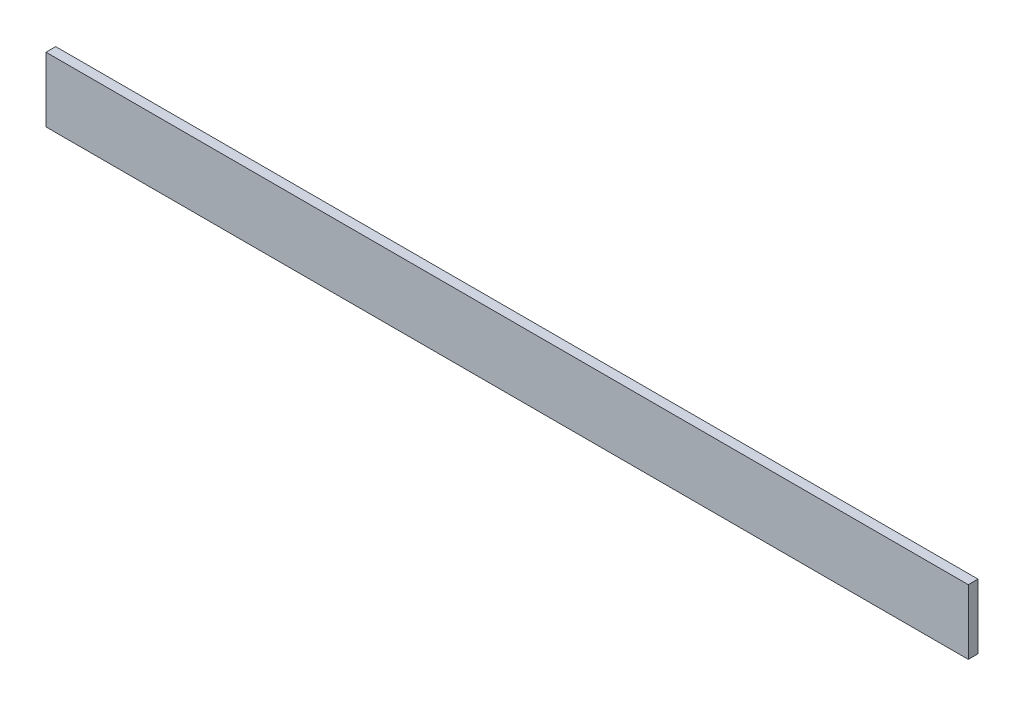
ISO-10303-21;
HEADER;
FILE_DESCRIPTION(('STEP AP214'),'2;1');
FILE_NAME('part.step','',(''),(''),'','','');
FILE_SCHEMA(('AUTOMOTIVE_DESIGN { 1 0 10303 214 1 1 1 1 }'));
ENDSEC;
DATA;
#1=APPLICATION_CONTEXT('core data for automotive mechanical design processes');
#2=APPLICATION_PROTOCOL_DEFINITION('international standard','automotive_design',2000,#1);
#3=PRODUCT_CONTEXT('',#1,'mechanical');
#4=PRODUCT('Part','Part','',(#3));
#5=PRODUCT_RELATED_PRODUCT_CATEGORY('part','',(#4));
#6=PRODUCT_DEFINITION_FORMATION('','',#4);
#7=PRODUCT_DEFINITION_CONTEXT('part definition',#1,'design');
#8=PRODUCT_DEFINITION('design','',#6,#7);
#9=PRODUCT_DEFINITION_SHAPE('','',#8);
#10=(LENGTH_UNIT() NAMED_UNIT(*) SI_UNIT(.MILLI.,.METRE.));
#11=(NAMED_UNIT(*) PLANE_ANGLE_UNIT() SI_UNIT($,.RADIAN.));
#12=(NAMED_UNIT(*) SI_UNIT($,.STERADIAN.) SOLID_ANGLE_UNIT());
#13=UNCERTAINTY_MEASURE_WITH_UNIT(LENGTH_MEASURE(1.E-05),#10,'distance_accuracy_value','');
#14=(GEOMETRIC_REPRESENTATION_CONTEXT(3) GLOBAL_UNCERTAINTY_ASSIGNED_CONTEXT((#13)) GLOBAL_UNIT_ASSIGNED_CONTEXT((#10,
#11,#12)) REPRESENTATION_CONTEXT('',''));
#15=CARTESIAN_POINT('',(0.,0.,0.));
#16=DIRECTION('',(0.,0.,1.));
#17=DIRECTION('',(1.,0.,0.));
#18=AXIS2_PLACEMENT_3D('',#15,#16,#17);
#19=CARTESIAN_POINT('',(142.5,23.,-70.5));
#20=DIRECTION('',(-1.,0.,0.));
#21=DIRECTION('',(0.,0.,1.));
#22=AXIS2_PLACEMENT_3D('',#19,#20,#21);
#23=PLANE('',#22);
#24=DIRECTION('',(0.,-1.,0.));
#25=VECTOR('',#24,1.);
#26=CARTESIAN_POINT('',(142.5,23.,-67.5));
#27=LINE('',#26,#25);
#28=CARTESIAN_POINT('',(142.5,23.,-67.5));
#29=VERTEX_POINT('',#28);
#30=CARTESIAN_POINT('',(142.5,3.,-67.5));
#31=VERTEX_POINT('',#30);
#32=EDGE_CURVE('E96',#29,#31,#27,.T.);
#33=ORIENTED_EDGE('',*,*,#32,.T.);
#34=DIRECTION('',(0.,0.,1.));
#35=VECTOR('',#34,1.);
#36=CARTESIAN_POINT('',(142.5,3.,-70.5));
#37=LINE('',#36,#35);
#38=CARTESIAN_POINT('',(142.5,3.,-70.5));
#39=VERTEX_POINT('',#38);
#40=EDGE_CURVE('E11',#39,#31,#37,.T.);
#41=ORIENTED_EDGE('',*,*,#40,.F.);
#42=DIRECTION('',(0.,-1.,0.));
#43=VECTOR('',#42,1.);
#44=CARTESIAN_POINT('',(142.5,23.,-70.5));
#45=LINE('',#44,#43);
#46=CARTESIAN_POINT('',(142.5,23.,-70.5));
#47=VERTEX_POINT('',#46);
#48=EDGE_CURVE('E84',#47,#39,#45,.T.);
#49=ORIENTED_EDGE('',*,*,#48,.F.);
#50=DIRECTION('',(0.,0.,1.));
#51=VECTOR('',#50,1.);
#52=CARTESIAN_POINT('',(142.5,23.,-70.5));
#53=LINE('',#52,#51);
#54=EDGE_CURVE('E92',#47,#29,#53,.T.);
#55=ORIENTED_EDGE('',*,*,#54,.T.);
#56=EDGE_LOOP('',(#33,#41,#49,#55));
#57=FACE_BOUND('',#56,.T.);
#58=ADVANCED_FACE('F33',(#57),#23,.F.);
#59=CARTESIAN_POINT('',(142.5,3.,-70.5));
#60=DIRECTION('',(0.,1.,0.));
#61=DIRECTION('',(0.,0.,1.));
#62=AXIS2_PLACEMENT_3D('',#59,#60,#61);
#63=PLANE('',#62);
#64=DIRECTION('',(-1.,0.,0.));
#65=VECTOR('',#64,1.);
#66=CARTESIAN_POINT('',(142.5,3.,-67.5));
#67=LINE('',#66,#65);
#68=CARTESIAN_POINT('',(-142.5,3.,-67.5));
#69=VERTEX_POINT('',#68);
#70=EDGE_CURVE('E88',#31,#69,#67,.T.);
#71=ORIENTED_EDGE('',*,*,#70,.T.);
#72=DIRECTION('',(0.,0.,1.));
#73=VECTOR('',#72,1.);
#74=CARTESIAN_POINT('',(-142.5,3.,-70.5));
#75=LINE('',#74,#73);
#76=CARTESIAN_POINT('',(-142.5,3.,-70.5));
#77=VERTEX_POINT('',#76);
#78=EDGE_CURVE('E41',#77,#69,#75,.T.);
#79=ORIENTED_EDGE('',*,*,#78,.F.);
#80=DIRECTION('',(-1.,0.,0.));
#81=VECTOR('',#80,1.);
#82=CARTESIAN_POINT('',(142.5,3.,-70.5));
#83=LINE('',#82,#81);
#84=EDGE_CURVE('E79',#39,#77,#83,.T.);
#85=ORIENTED_EDGE('',*,*,#84,.F.);
#86=ORIENTED_EDGE('',*,*,#40,.T.);
#87=EDGE_LOOP('',(#71,#79,#85,#86));
#88=FACE_BOUND('',#87,.T.);
#89=ADVANCED_FACE('F87',(#88),#63,.F.);
#90=CARTESIAN_POINT('',(-142.5,23.,-70.5));
#91=DIRECTION('',(1.,0.,0.));
#92=DIRECTION('',(0.,0.,-1.));
#93=AXIS2_PLACEMENT_3D('',#90,#91,#92);
#94=PLANE('',#93);
#95=DIRECTION('',(0.,1.,0.));
#96=VECTOR('',#95,1.);
#97=CARTESIAN_POINT('',(-142.5,23.,-67.5));
#98=LINE('',#97,#96);
#99=CARTESIAN_POINT('',(-142.5,23.,-67.5));
#100=VERTEX_POINT('',#99);
#101=EDGE_CURVE('E66',#69,#100,#98,.T.);
#102=ORIENTED_EDGE('',*,*,#101,.T.);
#103=DIRECTION('',(0.,0.,1.));
#104=VECTOR('',#103,1.);
#105=CARTESIAN_POINT('',(-142.5,23.,-70.5));
#106=LINE('',#105,#104);
#107=CARTESIAN_POINT('',(-142.5,23.,-70.5));
#108=VERTEX_POINT('',#107);
#109=EDGE_CURVE('E89',#108,#100,#106,.T.);
#110=ORIENTED_EDGE('',*,*,#109,.F.);
#111=DIRECTION('',(0.,1.,0.));
#112=VECTOR('',#111,1.);
#113=CARTESIAN_POINT('',(-142.5,23.,-70.5));
#114=LINE('',#113,#112);
#115=EDGE_CURVE('E82',#77,#108,#114,.T.);
#116=ORIENTED_EDGE('',*,*,#115,.F.);
#117=ORIENTED_EDGE('',*,*,#78,.T.);
#118=EDGE_LOOP('',(#102,#110,#116,#117));
#119=FACE_BOUND('',#118,.T.);
#120=ADVANCED_FACE('F90',(#119),#94,.F.);
#121=CARTESIAN_POINT('',(142.5,23.,-70.5));
#122=DIRECTION('',(0.,-1.,0.));
#123=DIRECTION('',(0.,0.,-1.));
#124=AXIS2_PLACEMENT_3D('',#121,#122,#123);
#125=PLANE('',#124);
#126=DIRECTION('',(1.,0.,0.));
#127=VECTOR('',#126,1.);
#128=CARTESIAN_POINT('',(142.5,23.,-67.5));
#129=LINE('',#128,#127);
#130=EDGE_CURVE('E72',#100,#29,#129,.T.);
#131=ORIENTED_EDGE('',*,*,#130,.T.);
#132=ORIENTED_EDGE('',*,*,#54,.F.);
#133=DIRECTION('',(1.,0.,0.));
#134=VECTOR('',#133,1.);
#135=CARTESIAN_POINT('',(142.5,23.,-70.5));
#136=LINE('',#135,#134);
#137=EDGE_CURVE('E49',#108,#47,#136,.T.);
#138=ORIENTED_EDGE('',*,*,#137,.F.);
#139=ORIENTED_EDGE('',*,*,#109,.T.);
#140=EDGE_LOOP('',(#131,#132,#138,#139));
#141=FACE_BOUND('',#140,.T.);
#142=ADVANCED_FACE('F103',(#141),#125,.F.);
#143=CARTESIAN_POINT('',(142.5,3.,-70.5));
#144=DIRECTION('',(0.,0.,-1.));
#145=DIRECTION('',(-1.,0.,0.));
#146=AXIS2_PLACEMENT_3D('',#143,#144,#145);
#147=PLANE('',#146);
#148=ORIENTED_EDGE('',*,*,#48,.T.);
#149=ORIENTED_EDGE('',*,*,#84,.T.);
#150=ORIENTED_EDGE('',*,*,#115,.T.);
#151=ORIENTED_EDGE('',*,*,#137,.T.);
#152=EDGE_LOOP('',(#148,#149,#150,#151));
#153=FACE_BOUND('',#152,.T.);
#154=ADVANCED_FACE('F80',(#153),#147,.T.);
#155=CARTESIAN_POINT('',(142.5,3.,-67.5));
#156=DIRECTION('',(0.,0.,-1.));
#157=DIRECTION('',(-1.,0.,0.));
#158=AXIS2_PLACEMENT_3D('',#155,#156,#157);
#159=PLANE('',#158);
#160=ORIENTED_EDGE('',*,*,#32,.F.);
#161=ORIENTED_EDGE('',*,*,#130,.F.);
#162=ORIENTED_EDGE('',*,*,#101,.F.);
#163=ORIENTED_EDGE('',*,*,#70,.F.);
#164=EDGE_LOOP('',(#160,#161,#162,#163));
#165=FACE_BOUND('',#164,.T.);
#166=ADVANCED_FACE('F106',(#165),#159,.F.);
#167=CLOSED_SHELL('',(#58,#89,#120,#142,#154,#166));
#168=MANIFOLD_SOLID_BREP('B2',#167);
#169=ADVANCED_BREP_SHAPE_REPRESENTATION('',(#18,#168),#14);
#170=SHAPE_DEFINITION_REPRESENTATION(#9,#169);
ENDSEC;
END-ISO-10303-21;
